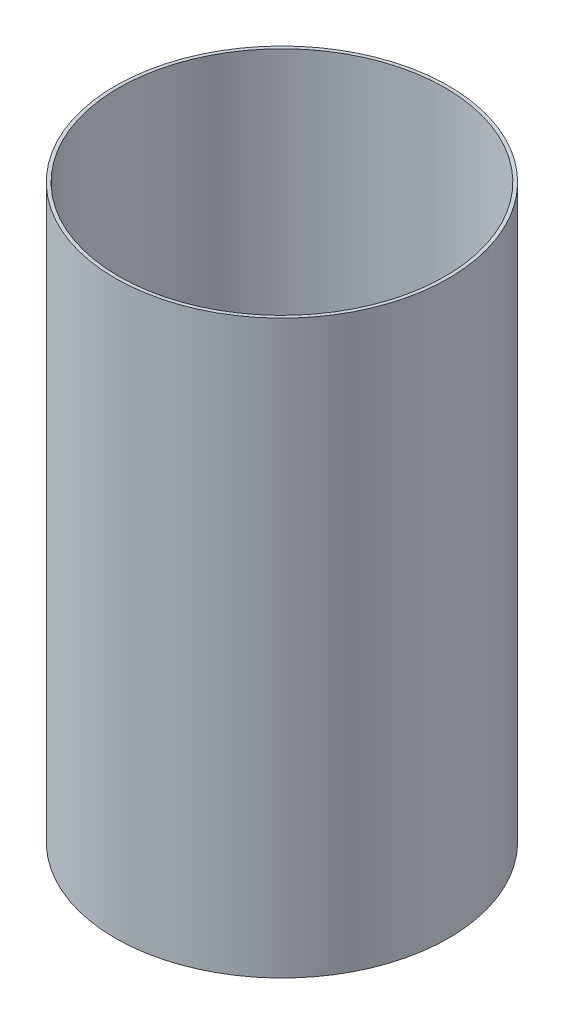
ISO-10303-21;
HEADER;
FILE_DESCRIPTION(('STEP AP214'),'2;1');
FILE_NAME('part.step','',(''),(''),'','','');
FILE_SCHEMA(('AUTOMOTIVE_DESIGN { 1 0 10303 214 1 1 1 1 }'));
ENDSEC;
DATA;
#1=APPLICATION_CONTEXT('core data for automotive mechanical design processes');
#2=APPLICATION_PROTOCOL_DEFINITION('international standard','automotive_design',2000,#1);
#3=PRODUCT_CONTEXT('',#1,'mechanical');
#4=PRODUCT('Part','Part','',(#3));
#5=PRODUCT_RELATED_PRODUCT_CATEGORY('part','',(#4));
#6=PRODUCT_DEFINITION_FORMATION('','',#4);
#7=PRODUCT_DEFINITION_CONTEXT('part definition',#1,'design');
#8=PRODUCT_DEFINITION('design','',#6,#7);
#9=PRODUCT_DEFINITION_SHAPE('','',#8);
#10=(LENGTH_UNIT() NAMED_UNIT(*) SI_UNIT(.MILLI.,.METRE.));
#11=(NAMED_UNIT(*) PLANE_ANGLE_UNIT() SI_UNIT($,.RADIAN.));
#12=(NAMED_UNIT(*) SI_UNIT($,.STERADIAN.) SOLID_ANGLE_UNIT());
#13=UNCERTAINTY_MEASURE_WITH_UNIT(LENGTH_MEASURE(1.E-05),#10,'distance_accuracy_value','');
#14=(GEOMETRIC_REPRESENTATION_CONTEXT(3) GLOBAL_UNCERTAINTY_ASSIGNED_CONTEXT((#13)) GLOBAL_UNIT_ASSIGNED_CONTEXT((#10,
#11,#12)) REPRESENTATION_CONTEXT('',''));
#15=CARTESIAN_POINT('',(0.,0.,0.));
#16=DIRECTION('',(0.,0.,1.));
#17=DIRECTION('',(1.,0.,0.));
#18=AXIS2_PLACEMENT_3D('',#15,#16,#17);
#19=CARTESIAN_POINT('',(0.,55.,0.));
#20=DIRECTION('',(0.,1.,0.));
#21=DIRECTION('',(0.,0.,1.));
#22=AXIS2_PLACEMENT_3D('',#19,#20,#21);
#23=CYLINDRICAL_SURFACE('',#22,38.8874);
#24=CARTESIAN_POINT('',(0.,-133.35,0.));
#25=DIRECTION('',(0.,1.,0.));
#26=DIRECTION('',(0.,0.,1.));
#27=AXIS2_PLACEMENT_3D('',#24,#25,#26);
#28=CIRCLE('',#27,38.8874);
#29=CARTESIAN_POINT('',(0.,-133.35,38.8874));
#30=VERTEX_POINT('',#29);
#31=EDGE_CURVE('E10',#30,#30,#28,.T.);
#32=ORIENTED_EDGE('',*,*,#31,.T.);
#33=EDGE_LOOP('',(#32));
#34=FACE_BOUND('',#33,.T.);
#35=CARTESIAN_POINT('',(0.,0.,0.));
#36=DIRECTION('',(0.,1.,0.));
#37=DIRECTION('',(0.,0.,1.));
#38=AXIS2_PLACEMENT_3D('',#35,#36,#37);
#39=CIRCLE('',#38,38.8874);
#40=CARTESIAN_POINT('',(0.,0.,38.8874));
#41=VERTEX_POINT('',#40);
#42=EDGE_CURVE('E46',#41,#41,#39,.T.);
#43=ORIENTED_EDGE('',*,*,#42,.F.);
#44=EDGE_LOOP('',(#43));
#45=FACE_BOUND('',#44,.T.);
#46=ADVANCED_FACE('F32',(#34,#45),#23,.T.);
#47=CARTESIAN_POINT('',(-38.8874,-133.35,0.));
#48=DIRECTION('',(0.,-1.,0.));
#49=DIRECTION('',(0.,0.,-1.));
#50=AXIS2_PLACEMENT_3D('',#47,#48,#49);
#51=PLANE('',#50);
#52=CARTESIAN_POINT('',(0.,-133.35,0.));
#53=DIRECTION('',(0.,1.,0.));
#54=DIRECTION('',(0.,0.,1.));
#55=AXIS2_PLACEMENT_3D('',#52,#53,#54);
#56=CIRCLE('',#55,38.1);
#57=CARTESIAN_POINT('',(0.,-133.35,38.1));
#58=VERTEX_POINT('',#57);
#59=EDGE_CURVE('E38',#58,#58,#56,.T.);
#60=ORIENTED_EDGE('',*,*,#59,.T.);
#61=EDGE_LOOP('',(#60));
#62=FACE_BOUND('',#61,.T.);
#63=ORIENTED_EDGE('',*,*,#31,.F.);
#64=EDGE_LOOP('',(#63));
#65=FACE_BOUND('',#64,.T.);
#66=ADVANCED_FACE('F56',(#62,#65),#51,.T.);
#67=CARTESIAN_POINT('',(0.,55.,0.));
#68=DIRECTION('',(0.,1.,0.));
#69=DIRECTION('',(0.,0.,1.));
#70=AXIS2_PLACEMENT_3D('',#67,#68,#69);
#71=CYLINDRICAL_SURFACE('',#70,38.1);
#72=CARTESIAN_POINT('',(0.,0.,0.));
#73=DIRECTION('',(0.,1.,0.));
#74=DIRECTION('',(0.,0.,1.));
#75=AXIS2_PLACEMENT_3D('',#72,#73,#74);
#76=CIRCLE('',#75,38.1);
#77=CARTESIAN_POINT('',(0.,0.,38.1));
#78=VERTEX_POINT('',#77);
#79=EDGE_CURVE('E42',#78,#78,#76,.T.);
#80=ORIENTED_EDGE('',*,*,#79,.T.);
#81=EDGE_LOOP('',(#80));
#82=FACE_BOUND('',#81,.T.);
#83=ORIENTED_EDGE('',*,*,#59,.F.);
#84=EDGE_LOOP('',(#83));
#85=FACE_BOUND('',#84,.T.);
#86=ADVANCED_FACE('F60',(#82,#85),#71,.F.);
#87=CARTESIAN_POINT('',(-38.8874,0.,0.));
#88=DIRECTION('',(0.,1.,0.));
#89=DIRECTION('',(0.,0.,1.));
#90=AXIS2_PLACEMENT_3D('',#87,#88,#89);
#91=PLANE('',#90);
#92=ORIENTED_EDGE('',*,*,#42,.T.);
#93=EDGE_LOOP('',(#92));
#94=FACE_BOUND('',#93,.T.);
#95=ORIENTED_EDGE('',*,*,#79,.F.);
#96=EDGE_LOOP('',(#95));
#97=FACE_BOUND('',#96,.T.);
#98=ADVANCED_FACE('F52',(#94,#97),#91,.T.);
#99=CLOSED_SHELL('',(#46,#66,#86,#98));
#100=MANIFOLD_SOLID_BREP('B2',#99);
#101=ADVANCED_BREP_SHAPE_REPRESENTATION('',(#18,#100),#14);
#102=SHAPE_DEFINITION_REPRESENTATION(#9,#101);
ENDSEC;
END-ISO-10303-21;
